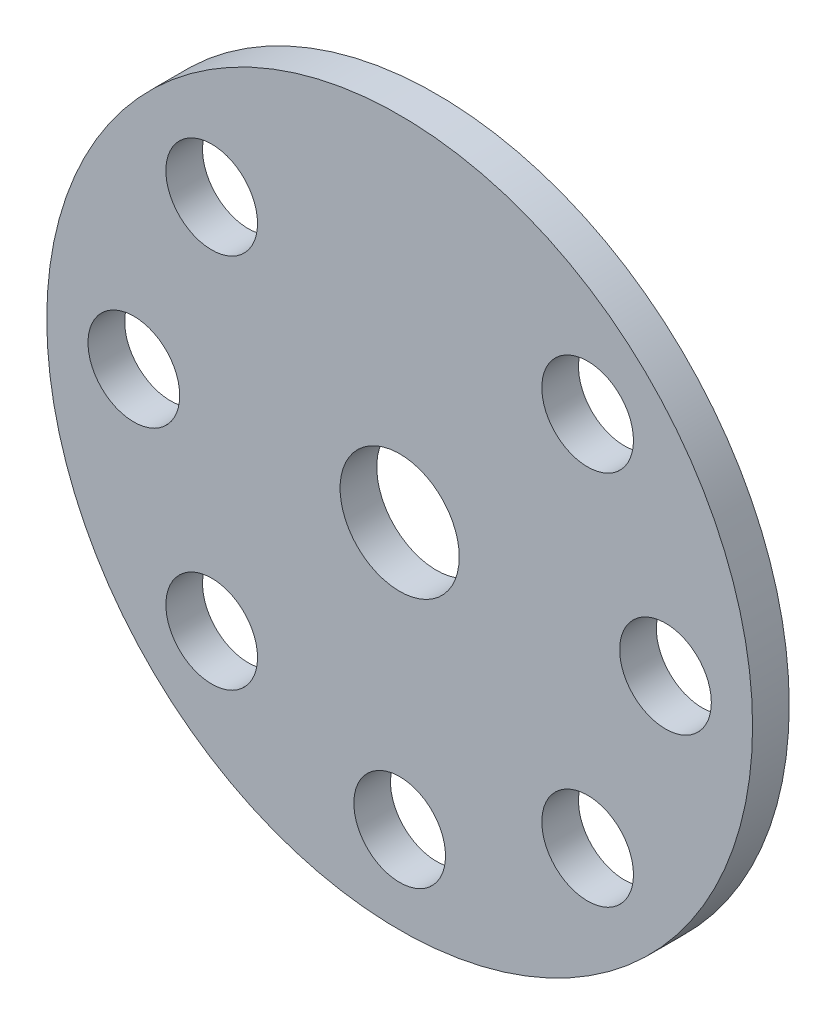
ISO-10303-21;
HEADER;
FILE_DESCRIPTION(('STEP AP214'),'2;1');
FILE_NAME('part.step','',(''),(''),'','','');
FILE_SCHEMA(('AUTOMOTIVE_DESIGN { 1 0 10303 214 1 1 1 1 }'));
ENDSEC;
DATA;
#1=APPLICATION_CONTEXT('core data for automotive mechanical design processes');
#2=APPLICATION_PROTOCOL_DEFINITION('international standard','automotive_design',2000,#1);
#3=PRODUCT_CONTEXT('',#1,'mechanical');
#4=PRODUCT('Part','Part','',(#3));
#5=PRODUCT_RELATED_PRODUCT_CATEGORY('part','',(#4));
#6=PRODUCT_DEFINITION_FORMATION('','',#4);
#7=PRODUCT_DEFINITION_CONTEXT('part definition',#1,'design');
#8=PRODUCT_DEFINITION('design','',#6,#7);
#9=PRODUCT_DEFINITION_SHAPE('','',#8);
#10=(LENGTH_UNIT() NAMED_UNIT(*) SI_UNIT(.MILLI.,.METRE.));
#11=(NAMED_UNIT(*) PLANE_ANGLE_UNIT() SI_UNIT($,.RADIAN.));
#12=(NAMED_UNIT(*) SI_UNIT($,.STERADIAN.) SOLID_ANGLE_UNIT());
#13=UNCERTAINTY_MEASURE_WITH_UNIT(LENGTH_MEASURE(1.E-05),#10,'distance_accuracy_value','');
#14=(GEOMETRIC_REPRESENTATION_CONTEXT(3) GLOBAL_UNCERTAINTY_ASSIGNED_CONTEXT((#13)) GLOBAL_UNIT_ASSIGNED_CONTEXT((#10,
#11,#12)) REPRESENTATION_CONTEXT('',''));
#15=CARTESIAN_POINT('',(0.,0.,0.));
#16=DIRECTION('',(0.,0.,1.));
#17=DIRECTION('',(1.,0.,0.));
#18=AXIS2_PLACEMENT_3D('',#15,#16,#17);
#19=CARTESIAN_POINT('',(0.,0.,2.));
#20=DIRECTION('',(0.,0.,-1.));
#21=DIRECTION('',(-1.,0.,0.));
#22=AXIS2_PLACEMENT_3D('',#19,#20,#21);
#23=CYLINDRICAL_SURFACE('',#22,19.25);
#24=CARTESIAN_POINT('',(0.,0.,2.));
#25=DIRECTION('',(0.,0.,1.));
#26=DIRECTION('',(1.,0.,0.));
#27=AXIS2_PLACEMENT_3D('',#24,#25,#26);
#28=CIRCLE('',#27,19.25);
#29=CARTESIAN_POINT('',(19.25,0.,2.));
#30=VERTEX_POINT('',#29);
#31=EDGE_CURVE('E10',#30,#30,#28,.T.);
#32=ORIENTED_EDGE('',*,*,#31,.F.);
#33=EDGE_LOOP('',(#32));
#34=FACE_BOUND('',#33,.T.);
#35=CARTESIAN_POINT('',(0.,0.,0.));
#36=DIRECTION('',(0.,0.,1.));
#37=DIRECTION('',(1.,0.,0.));
#38=AXIS2_PLACEMENT_3D('',#35,#36,#37);
#39=CIRCLE('',#38,19.25);
#40=CARTESIAN_POINT('',(19.25,0.,0.));
#41=VERTEX_POINT('',#40);
#42=EDGE_CURVE('E33',#41,#41,#39,.T.);
#43=ORIENTED_EDGE('',*,*,#42,.T.);
#44=EDGE_LOOP('',(#43));
#45=FACE_BOUND('',#44,.T.);
#46=ADVANCED_FACE('F30',(#34,#45),#23,.T.);
#47=CARTESIAN_POINT('',(0.,0.,2.));
#48=DIRECTION('',(0.,0.,1.));
#49=DIRECTION('',(1.,0.,0.));
#50=AXIS2_PLACEMENT_3D('',#47,#48,#49);
#51=PLANE('',#50);
#52=CARTESIAN_POINT('',(0.,0.,2.));
#53=DIRECTION('',(0.,0.,1.));
#54=DIRECTION('',(1.,0.,0.));
#55=AXIS2_PLACEMENT_3D('',#52,#53,#54);
#56=CIRCLE('',#55,3.25);
#57=CARTESIAN_POINT('',(3.25,0.,2.));
#58=VERTEX_POINT('',#57);
#59=EDGE_CURVE('E84',#58,#58,#56,.T.);
#60=ORIENTED_EDGE('',*,*,#59,.F.);
#61=EDGE_LOOP('',(#60));
#62=FACE_BOUND('',#61,.T.);
#63=CARTESIAN_POINT('',(10.2530483272049,10.2530483272049,2.));
#64=DIRECTION('',(0.,0.,1.));
#65=DIRECTION('',(1.,0.,0.));
#66=AXIS2_PLACEMENT_3D('',#63,#64,#65);
#67=CIRCLE('',#66,2.5);
#68=CARTESIAN_POINT('',(12.7530483272049,10.2530483272049,2.));
#69=VERTEX_POINT('',#68);
#70=EDGE_CURVE('E78',#69,#69,#67,.T.);
#71=ORIENTED_EDGE('',*,*,#70,.F.);
#72=EDGE_LOOP('',(#71));
#73=FACE_BOUND('',#72,.T.);
#74=CARTESIAN_POINT('',(14.5,0.,2.));
#75=DIRECTION('',(0.,0.,1.));
#76=DIRECTION('',(1.,0.,0.));
#77=AXIS2_PLACEMENT_3D('',#74,#75,#76);
#78=CIRCLE('',#77,2.5);
#79=CARTESIAN_POINT('',(17.,0.,2.));
#80=VERTEX_POINT('',#79);
#81=EDGE_CURVE('E72',#80,#80,#78,.T.);
#82=ORIENTED_EDGE('',*,*,#81,.F.);
#83=EDGE_LOOP('',(#82));
#84=FACE_BOUND('',#83,.T.);
#85=CARTESIAN_POINT('',(10.2530483272049,-10.2530483272049,2.));
#86=DIRECTION('',(0.,0.,1.));
#87=DIRECTION('',(1.,0.,0.));
#88=AXIS2_PLACEMENT_3D('',#85,#86,#87);
#89=CIRCLE('',#88,2.5);
#90=CARTESIAN_POINT('',(12.7530483272049,-10.2530483272049,2.));
#91=VERTEX_POINT('',#90);
#92=EDGE_CURVE('E66',#91,#91,#89,.T.);
#93=ORIENTED_EDGE('',*,*,#92,.F.);
#94=EDGE_LOOP('',(#93));
#95=FACE_BOUND('',#94,.T.);
#96=CARTESIAN_POINT('',(0.,-14.5,2.));
#97=DIRECTION('',(0.,0.,1.));
#98=DIRECTION('',(1.,0.,0.));
#99=AXIS2_PLACEMENT_3D('',#96,#97,#98);
#100=CIRCLE('',#99,2.5);
#101=CARTESIAN_POINT('',(2.50000000000001,-14.5,2.));
#102=VERTEX_POINT('',#101);
#103=EDGE_CURVE('E60',#102,#102,#100,.T.);
#104=ORIENTED_EDGE('',*,*,#103,.F.);
#105=EDGE_LOOP('',(#104));
#106=FACE_BOUND('',#105,.T.);
#107=CARTESIAN_POINT('',(-10.2530483272049,-10.2530483272049,2.));
#108=DIRECTION('',(0.,0.,1.));
#109=DIRECTION('',(1.,0.,0.));
#110=AXIS2_PLACEMENT_3D('',#107,#108,#109);
#111=CIRCLE('',#110,2.5);
#112=CARTESIAN_POINT('',(-7.75304832720493,-10.2530483272049,2.));
#113=VERTEX_POINT('',#112);
#114=EDGE_CURVE('E54',#113,#113,#111,.T.);
#115=ORIENTED_EDGE('',*,*,#114,.F.);
#116=EDGE_LOOP('',(#115));
#117=FACE_BOUND('',#116,.T.);
#118=CARTESIAN_POINT('',(-14.5,0.,2.));
#119=DIRECTION('',(0.,0.,1.));
#120=DIRECTION('',(1.,0.,0.));
#121=AXIS2_PLACEMENT_3D('',#118,#119,#120);
#122=CIRCLE('',#121,2.5);
#123=CARTESIAN_POINT('',(-12.,0.,2.));
#124=VERTEX_POINT('',#123);
#125=EDGE_CURVE('E48',#124,#124,#122,.T.);
#126=ORIENTED_EDGE('',*,*,#125,.F.);
#127=EDGE_LOOP('',(#126));
#128=FACE_BOUND('',#127,.T.);
#129=CARTESIAN_POINT('',(-10.2530483272049,10.2530483272049,2.));
#130=DIRECTION('',(0.,0.,1.));
#131=DIRECTION('',(1.,0.,0.));
#132=AXIS2_PLACEMENT_3D('',#129,#130,#131);
#133=CIRCLE('',#132,2.5);
#134=CARTESIAN_POINT('',(-7.75304832720493,10.2530483272049,2.));
#135=VERTEX_POINT('',#134);
#136=EDGE_CURVE('E42',#135,#135,#133,.T.);
#137=ORIENTED_EDGE('',*,*,#136,.F.);
#138=EDGE_LOOP('',(#137));
#139=FACE_BOUND('',#138,.T.);
#140=ORIENTED_EDGE('',*,*,#31,.T.);
#141=EDGE_LOOP('',(#140));
#142=FACE_BOUND('',#141,.T.);
#143=ADVANCED_FACE('F100',(#62,#73,#84,#95,#106,#117,#128,#139,#142),#51,.T.);
#144=CARTESIAN_POINT('',(0.,0.,0.));
#145=DIRECTION('',(0.,0.,1.));
#146=DIRECTION('',(1.,0.,0.));
#147=AXIS2_PLACEMENT_3D('',#144,#145,#146);
#148=PLANE('',#147);
#149=CARTESIAN_POINT('',(0.,0.,0.));
#150=DIRECTION('',(0.,0.,1.));
#151=DIRECTION('',(1.,0.,0.));
#152=AXIS2_PLACEMENT_3D('',#149,#150,#151);
#153=CIRCLE('',#152,3.25);
#154=CARTESIAN_POINT('',(3.25,0.,0.));
#155=VERTEX_POINT('',#154);
#156=EDGE_CURVE('E81',#155,#155,#153,.T.);
#157=ORIENTED_EDGE('',*,*,#156,.T.);
#158=EDGE_LOOP('',(#157));
#159=FACE_BOUND('',#158,.T.);
#160=CARTESIAN_POINT('',(10.2530483272049,10.2530483272049,0.));
#161=DIRECTION('',(0.,0.,1.));
#162=DIRECTION('',(1.,0.,0.));
#163=AXIS2_PLACEMENT_3D('',#160,#161,#162);
#164=CIRCLE('',#163,2.5);
#165=CARTESIAN_POINT('',(12.7530483272049,10.2530483272049,0.));
#166=VERTEX_POINT('',#165);
#167=EDGE_CURVE('E75',#166,#166,#164,.T.);
#168=ORIENTED_EDGE('',*,*,#167,.T.);
#169=EDGE_LOOP('',(#168));
#170=FACE_BOUND('',#169,.T.);
#171=CARTESIAN_POINT('',(14.5,0.,0.));
#172=DIRECTION('',(0.,0.,1.));
#173=DIRECTION('',(1.,0.,0.));
#174=AXIS2_PLACEMENT_3D('',#171,#172,#173);
#175=CIRCLE('',#174,2.5);
#176=CARTESIAN_POINT('',(17.,0.,0.));
#177=VERTEX_POINT('',#176);
#178=EDGE_CURVE('E69',#177,#177,#175,.T.);
#179=ORIENTED_EDGE('',*,*,#178,.T.);
#180=EDGE_LOOP('',(#179));
#181=FACE_BOUND('',#180,.T.);
#182=CARTESIAN_POINT('',(10.2530483272049,-10.2530483272049,0.));
#183=DIRECTION('',(0.,0.,1.));
#184=DIRECTION('',(1.,0.,0.));
#185=AXIS2_PLACEMENT_3D('',#182,#183,#184);
#186=CIRCLE('',#185,2.5);
#187=CARTESIAN_POINT('',(12.7530483272049,-10.2530483272049,0.));
#188=VERTEX_POINT('',#187);
#189=EDGE_CURVE('E63',#188,#188,#186,.T.);
#190=ORIENTED_EDGE('',*,*,#189,.T.);
#191=EDGE_LOOP('',(#190));
#192=FACE_BOUND('',#191,.T.);
#193=CARTESIAN_POINT('',(0.,-14.5,0.));
#194=DIRECTION('',(0.,0.,1.));
#195=DIRECTION('',(1.,0.,0.));
#196=AXIS2_PLACEMENT_3D('',#193,#194,#195);
#197=CIRCLE('',#196,2.5);
#198=CARTESIAN_POINT('',(2.50000000000001,-14.5,0.));
#199=VERTEX_POINT('',#198);
#200=EDGE_CURVE('E57',#199,#199,#197,.T.);
#201=ORIENTED_EDGE('',*,*,#200,.T.);
#202=EDGE_LOOP('',(#201));
#203=FACE_BOUND('',#202,.T.);
#204=CARTESIAN_POINT('',(-10.2530483272049,-10.2530483272049,0.));
#205=DIRECTION('',(0.,0.,1.));
#206=DIRECTION('',(1.,0.,0.));
#207=AXIS2_PLACEMENT_3D('',#204,#205,#206);
#208=CIRCLE('',#207,2.5);
#209=CARTESIAN_POINT('',(-7.75304832720493,-10.2530483272049,0.));
#210=VERTEX_POINT('',#209);
#211=EDGE_CURVE('E51',#210,#210,#208,.T.);
#212=ORIENTED_EDGE('',*,*,#211,.T.);
#213=EDGE_LOOP('',(#212));
#214=FACE_BOUND('',#213,.T.);
#215=CARTESIAN_POINT('',(-14.5,0.,0.));
#216=DIRECTION('',(0.,0.,1.));
#217=DIRECTION('',(1.,0.,0.));
#218=AXIS2_PLACEMENT_3D('',#215,#216,#217);
#219=CIRCLE('',#218,2.5);
#220=CARTESIAN_POINT('',(-12.,0.,0.));
#221=VERTEX_POINT('',#220);
#222=EDGE_CURVE('E45',#221,#221,#219,.T.);
#223=ORIENTED_EDGE('',*,*,#222,.T.);
#224=EDGE_LOOP('',(#223));
#225=FACE_BOUND('',#224,.T.);
#226=CARTESIAN_POINT('',(-10.2530483272049,10.2530483272049,0.));
#227=DIRECTION('',(0.,0.,1.));
#228=DIRECTION('',(1.,0.,0.));
#229=AXIS2_PLACEMENT_3D('',#226,#227,#228);
#230=CIRCLE('',#229,2.5);
#231=CARTESIAN_POINT('',(-7.75304832720493,10.2530483272049,0.));
#232=VERTEX_POINT('',#231);
#233=EDGE_CURVE('E40',#232,#232,#230,.T.);
#234=ORIENTED_EDGE('',*,*,#233,.T.);
#235=EDGE_LOOP('',(#234));
#236=FACE_BOUND('',#235,.T.);
#237=ORIENTED_EDGE('',*,*,#42,.F.);
#238=EDGE_LOOP('',(#237));
#239=FACE_BOUND('',#238,.T.);
#240=ADVANCED_FACE('F90',(#159,#170,#181,#192,#203,#214,#225,#236,#239),#148,.F.);
#241=CARTESIAN_POINT('',(-10.2530483272049,10.2530483272049,0.));
#242=DIRECTION('',(0.,0.,1.));
#243=DIRECTION('',(1.,0.,0.));
#244=AXIS2_PLACEMENT_3D('',#241,#242,#243);
#245=CYLINDRICAL_SURFACE('',#244,2.5);
#246=ORIENTED_EDGE('',*,*,#233,.F.);
#247=EDGE_LOOP('',(#246));
#248=FACE_BOUND('',#247,.T.);
#249=ORIENTED_EDGE('',*,*,#136,.T.);
#250=EDGE_LOOP('',(#249));
#251=FACE_BOUND('',#250,.T.);
#252=ADVANCED_FACE('F118',(#248,#251),#245,.F.);
#253=CARTESIAN_POINT('',(-14.5,0.,0.));
#254=DIRECTION('',(0.,0.,1.));
#255=DIRECTION('',(1.,0.,0.));
#256=AXIS2_PLACEMENT_3D('',#253,#254,#255);
#257=CYLINDRICAL_SURFACE('',#256,2.5);
#258=ORIENTED_EDGE('',*,*,#222,.F.);
#259=EDGE_LOOP('',(#258));
#260=FACE_BOUND('',#259,.T.);
#261=ORIENTED_EDGE('',*,*,#125,.T.);
#262=EDGE_LOOP('',(#261));
#263=FACE_BOUND('',#262,.T.);
#264=ADVANCED_FACE('F120',(#260,#263),#257,.F.);
#265=CARTESIAN_POINT('',(-10.2530483272049,-10.2530483272049,0.));
#266=DIRECTION('',(0.,0.,1.));
#267=DIRECTION('',(1.,0.,0.));
#268=AXIS2_PLACEMENT_3D('',#265,#266,#267);
#269=CYLINDRICAL_SURFACE('',#268,2.5);
#270=ORIENTED_EDGE('',*,*,#211,.F.);
#271=EDGE_LOOP('',(#270));
#272=FACE_BOUND('',#271,.T.);
#273=ORIENTED_EDGE('',*,*,#114,.T.);
#274=EDGE_LOOP('',(#273));
#275=FACE_BOUND('',#274,.T.);
#276=ADVANCED_FACE('F127',(#272,#275),#269,.F.);
#277=CARTESIAN_POINT('',(0.,-14.5,0.));
#278=DIRECTION('',(0.,0.,1.));
#279=DIRECTION('',(1.,0.,0.));
#280=AXIS2_PLACEMENT_3D('',#277,#278,#279);
#281=CYLINDRICAL_SURFACE('',#280,2.5);
#282=ORIENTED_EDGE('',*,*,#200,.F.);
#283=EDGE_LOOP('',(#282));
#284=FACE_BOUND('',#283,.T.);
#285=ORIENTED_EDGE('',*,*,#103,.T.);
#286=EDGE_LOOP('',(#285));
#287=FACE_BOUND('',#286,.T.);
#288=ADVANCED_FACE('F165',(#284,#287),#281,.F.);
#289=CARTESIAN_POINT('',(10.2530483272049,-10.2530483272049,0.));
#290=DIRECTION('',(0.,0.,1.));
#291=DIRECTION('',(1.,0.,0.));
#292=AXIS2_PLACEMENT_3D('',#289,#290,#291);
#293=CYLINDRICAL_SURFACE('',#292,2.5);
#294=ORIENTED_EDGE('',*,*,#189,.F.);
#295=EDGE_LOOP('',(#294));
#296=FACE_BOUND('',#295,.T.);
#297=ORIENTED_EDGE('',*,*,#92,.T.);
#298=EDGE_LOOP('',(#297));
#299=FACE_BOUND('',#298,.T.);
#300=ADVANCED_FACE('F175',(#296,#299),#293,.F.);
#301=CARTESIAN_POINT('',(14.5,0.,0.));
#302=DIRECTION('',(0.,0.,1.));
#303=DIRECTION('',(1.,0.,0.));
#304=AXIS2_PLACEMENT_3D('',#301,#302,#303);
#305=CYLINDRICAL_SURFACE('',#304,2.5);
#306=ORIENTED_EDGE('',*,*,#178,.F.);
#307=EDGE_LOOP('',(#306));
#308=FACE_BOUND('',#307,.T.);
#309=ORIENTED_EDGE('',*,*,#81,.T.);
#310=EDGE_LOOP('',(#309));
#311=FACE_BOUND('',#310,.T.);
#312=ADVANCED_FACE('F185',(#308,#311),#305,.F.);
#313=CARTESIAN_POINT('',(10.2530483272049,10.2530483272049,0.));
#314=DIRECTION('',(0.,0.,1.));
#315=DIRECTION('',(1.,0.,0.));
#316=AXIS2_PLACEMENT_3D('',#313,#314,#315);
#317=CYLINDRICAL_SURFACE('',#316,2.5);
#318=ORIENTED_EDGE('',*,*,#167,.F.);
#319=EDGE_LOOP('',(#318));
#320=FACE_BOUND('',#319,.T.);
#321=ORIENTED_EDGE('',*,*,#70,.T.);
#322=EDGE_LOOP('',(#321));
#323=FACE_BOUND('',#322,.T.);
#324=ADVANCED_FACE('F96',(#320,#323),#317,.F.);
#325=CARTESIAN_POINT('',(0.,0.,0.));
#326=DIRECTION('',(0.,0.,1.));
#327=DIRECTION('',(1.,0.,0.));
#328=AXIS2_PLACEMENT_3D('',#325,#326,#327);
#329=CYLINDRICAL_SURFACE('',#328,3.25);
#330=ORIENTED_EDGE('',*,*,#156,.F.);
#331=EDGE_LOOP('',(#330));
#332=FACE_BOUND('',#331,.T.);
#333=ORIENTED_EDGE('',*,*,#59,.T.);
#334=EDGE_LOOP('',(#333));
#335=FACE_BOUND('',#334,.T.);
#336=ADVANCED_FACE('F93',(#332,#335),#329,.F.);
#337=CLOSED_SHELL('',(#46,#143,#240,#252,#264,#276,#288,#300,#312,#324,#336));
#338=MANIFOLD_SOLID_BREP('B2',#337);
#339=ADVANCED_BREP_SHAPE_REPRESENTATION('',(#18,#338),#14);
#340=SHAPE_DEFINITION_REPRESENTATION(#9,#339);
ENDSEC;
END-ISO-10303-21;
